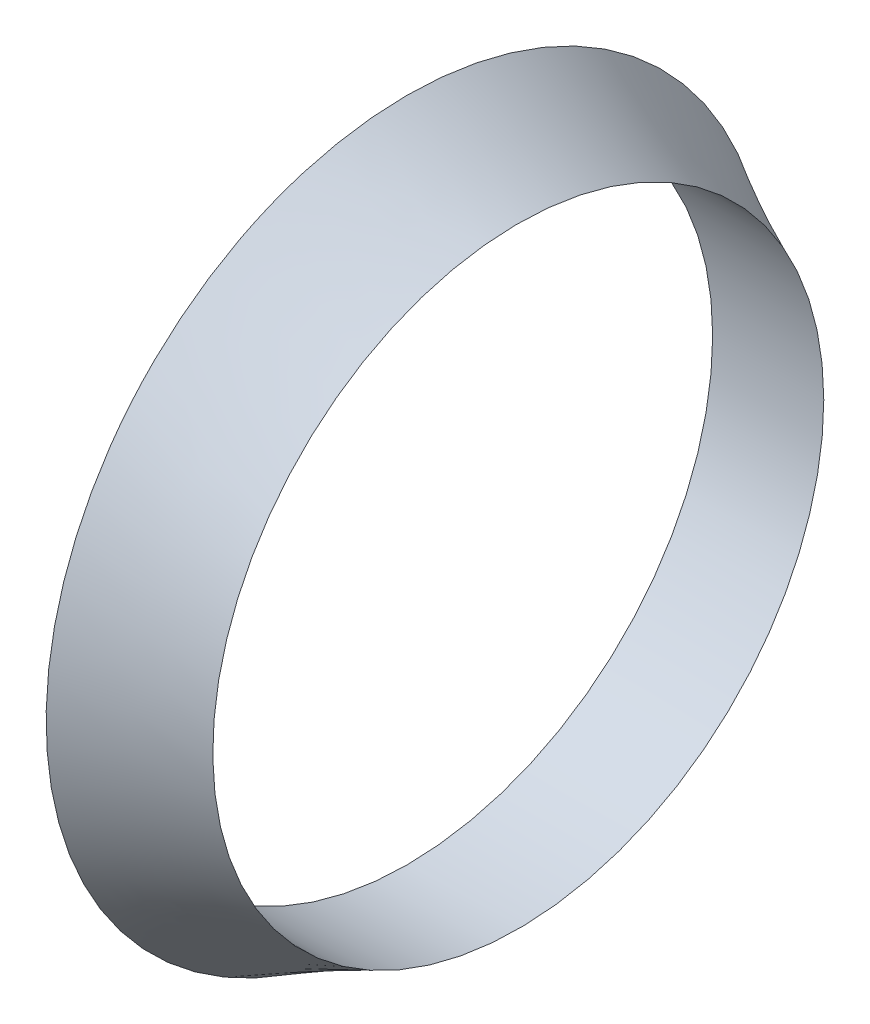
ISO-10303-21;
HEADER;
FILE_DESCRIPTION(('STEP AP214'),'2;1');
FILE_NAME('part.step','',(''),(''),'','','');
FILE_SCHEMA(('AUTOMOTIVE_DESIGN { 1 0 10303 214 1 1 1 1 }'));
ENDSEC;
DATA;
#1=APPLICATION_CONTEXT('core data for automotive mechanical design processes');
#2=APPLICATION_PROTOCOL_DEFINITION('international standard','automotive_design',2000,#1);
#3=PRODUCT_CONTEXT('',#1,'mechanical');
#4=PRODUCT('Part','Part','',(#3));
#5=PRODUCT_RELATED_PRODUCT_CATEGORY('part','',(#4));
#6=PRODUCT_DEFINITION_FORMATION('','',#4);
#7=PRODUCT_DEFINITION_CONTEXT('part definition',#1,'design');
#8=PRODUCT_DEFINITION('design','',#6,#7);
#9=PRODUCT_DEFINITION_SHAPE('','',#8);
#10=(LENGTH_UNIT() NAMED_UNIT(*) SI_UNIT(.MILLI.,.METRE.));
#11=(NAMED_UNIT(*) PLANE_ANGLE_UNIT() SI_UNIT($,.RADIAN.));
#12=(NAMED_UNIT(*) SI_UNIT($,.STERADIAN.) SOLID_ANGLE_UNIT());
#13=UNCERTAINTY_MEASURE_WITH_UNIT(LENGTH_MEASURE(1.E-05),#10,'distance_accuracy_value','');
#14=(GEOMETRIC_REPRESENTATION_CONTEXT(3) GLOBAL_UNCERTAINTY_ASSIGNED_CONTEXT((#13)) GLOBAL_UNIT_ASSIGNED_CONTEXT((#10,
#11,#12)) REPRESENTATION_CONTEXT('',''));
#15=CARTESIAN_POINT('',(0.,0.,0.));
#16=DIRECTION('',(0.,0.,1.));
#17=DIRECTION('',(1.,0.,0.));
#18=AXIS2_PLACEMENT_3D('',#15,#16,#17);
#19=CARTESIAN_POINT('',(0.,0.,0.));
#20=DIRECTION('',(1.,0.,0.));
#21=DIRECTION('',(0.,0.,-1.));
#22=AXIS2_PLACEMENT_3D('',#19,#20,#21);
#23=PLANE('',#22);
#24=CARTESIAN_POINT('',(0.,0.,7.20947868796138E-13));
#25=DIRECTION('',(1.,0.,0.));
#26=DIRECTION('',(0.,0.,-1.));
#27=AXIS2_PLACEMENT_3D('',#24,#25,#26);
#28=CIRCLE('',#27,55.0000000000001);
#29=CARTESIAN_POINT('',(0.,0.,-54.9999999999993));
#30=VERTEX_POINT('',#29);
#31=EDGE_CURVE('E49',#30,#30,#28,.T.);
#32=ORIENTED_EDGE('',*,*,#31,.T.);
#33=EDGE_LOOP('',(#32));
#34=FACE_BOUND('',#33,.T.);
#35=CARTESIAN_POINT('',(0.,0.,0.));
#36=DIRECTION('',(1.,0.,0.));
#37=DIRECTION('',(0.,0.,-1.));
#38=AXIS2_PLACEMENT_3D('',#35,#36,#37);
#39=CIRCLE('',#38,65.);
#40=CARTESIAN_POINT('',(0.,-52.5620886920741,-38.2390746792667));
#41=VERTEX_POINT('',#40);
#42=EDGE_CURVE('E11',#41,#41,#39,.T.);
#43=ORIENTED_EDGE('',*,*,#42,.F.);
#44=EDGE_LOOP('',(#43));
#45=FACE_BOUND('',#44,.T.);
#46=ADVANCED_FACE('F41',(#34,#45),#23,.F.);
#47=CARTESIAN_POINT('',(20.0000000000003,-35.7984123857661,-41.7549239091458));
#48=CARTESIAN_POINT('',(0.,-52.5620886920741,-38.2390746792667));
#49=CARTESIAN_POINT('',(19.9999999999998,-119.308260204059,29.8419008623865));
#50=CARTESIAN_POINT('',(0.,-129.040238050608,66.8851027048815));
#51=CARTESIAN_POINT('',(19.9999999999992,-47.7114354325271,113.35174868068));
#52=CARTESIAN_POINT('',(0.,-23.9160606664593,143.363252063415));
#53=CARTESIAN_POINT('',(19.9999999999997,35.7984123857662,41.7549239091475));
#54=CARTESIAN_POINT('',(0.,52.5620886920741,38.2390746792667));
#55=CARTESIAN_POINT('',(20.0000000000002,119.308260204059,-29.8419008623849));
#56=CARTESIAN_POINT('',(0.,129.040238050608,-66.8851027048813));
#57=CARTESIAN_POINT('',(20.0000000000008,47.7114354325271,-113.351748680678));
#58=CARTESIAN_POINT('',(0.,23.9160606664594,-143.363252063415));
#59=CARTESIAN_POINT('',(20.0000000000003,-35.7984123857661,-41.7549239091458));
#60=CARTESIAN_POINT('',(0.,-52.5620886920741,-38.2390746792667));
#61=(BOUNDED_SURFACE() B_SPLINE_SURFACE(3,1,((#47,#48),(#49,#50),(#51,#52),(#53,#54),(#55,#56),
(#57,#58),(#59,#60)),.UNSPECIFIED.,.T.,.F.,.F.) B_SPLINE_SURFACE_WITH_KNOTS((4,3,4),(2,2),(0.,
0.5,1.),(0.,1.),.UNSPECIFIED.) GEOMETRIC_REPRESENTATION_ITEM() RATIONAL_B_SPLINE_SURFACE(((1.,
1.),(0.333333333333333,0.333333333333333),(0.333333333333333,0.333333333333333),(1.,1.),
(0.333333333333333,0.333333333333334),(0.333333333333333,0.333333333333334),(1.,1.))) REPRESENTATION_ITEM('') SURFACE());
#62=CARTESIAN_POINT('',(20.,0.,8.60607122349863E-13));
#63=DIRECTION('',(1.,0.,0.));
#64=DIRECTION('',(0.,0.,-1.));
#65=AXIS2_PLACEMENT_3D('',#62,#63,#64);
#66=CIRCLE('',#65,55.0000000000001);
#67=CARTESIAN_POINT('',(20.0000000000003,-35.7984123857661,-41.7549239091458));
#68=VERTEX_POINT('',#67);
#69=EDGE_CURVE('E55',#68,#68,#66,.T.);
#70=CARTESIAN_POINT('',(20.0000000000003,-35.7984123857661,-41.7549239091458));
#71=CARTESIAN_POINT('',(19.791666666667,-35.9730340139568,-41.7183004796679));
#72=CARTESIAN_POINT('',(19.5833333333336,-36.1476556421476,-41.68167705019));
#73=CARTESIAN_POINT('',(19.1666666666669,-36.496898898529,-41.6084301912341));
#74=CARTESIAN_POINT('',(18.9583333333336,-36.6715205267197,-41.5718067617562));
#75=CARTESIAN_POINT('',(18.5416666666669,-37.0207637831011,-41.4985599028004));
#76=CARTESIAN_POINT('',(18.3333333333336,-37.1953854112918,-41.4619364733225));
#77=CARTESIAN_POINT('',(17.9166666666669,-37.5446286676732,-41.3886896143667));
#78=CARTESIAN_POINT('',(17.7083333333336,-37.7192502958639,-41.3520661848888));
#79=CARTESIAN_POINT('',(17.2916666666669,-38.0684935522454,-41.278819325933));
#80=CARTESIAN_POINT('',(17.0833333333336,-38.243115180436,-41.2421958964551));
#81=CARTESIAN_POINT('',(16.6666666666669,-38.5923584368175,-41.1689490374993));
#82=CARTESIAN_POINT('',(16.4583333333336,-38.7669800650082,-41.1323256080214));
#83=CARTESIAN_POINT('',(16.0416666666669,-39.1162233213896,-41.0590787490655));
#84=CARTESIAN_POINT('',(15.8333333333336,-39.2908449495803,-41.0224553195876));
#85=CARTESIAN_POINT('',(15.4166666666669,-39.6400882059617,-40.9492084606318));
#86=CARTESIAN_POINT('',(15.2083333333336,-39.8147098341524,-40.9125850311539));
#87=CARTESIAN_POINT('',(14.7916666666669,-40.1639530905338,-40.8393381721981));
#88=CARTESIAN_POINT('',(14.5833333333335,-40.3385747187245,-40.8027147427202));
#89=CARTESIAN_POINT('',(14.1666666666669,-40.687817975106,-40.7294678837644));
#90=CARTESIAN_POINT('',(13.9583333333335,-40.8624396032967,-40.6928444542865));
#91=CARTESIAN_POINT('',(13.5416666666669,-41.2116828596781,-40.6195975953307));
#92=CARTESIAN_POINT('',(13.3333333333335,-41.3863044878688,-40.5829741658527));
#93=CARTESIAN_POINT('',(12.9166666666669,-41.7355477442502,-40.5097273068969));
#94=CARTESIAN_POINT('',(12.7083333333335,-41.9101693724409,-40.473103877419));
#95=CARTESIAN_POINT('',(12.2916666666668,-42.2594126288223,-40.3998570184632));
#96=CARTESIAN_POINT('',(12.0833333333335,-42.434034257013,-40.3632335889853));
#97=CARTESIAN_POINT('',(11.6666666666668,-42.7832775133945,-40.2899867300295));
#98=CARTESIAN_POINT('',(11.4583333333335,-42.9578991415852,-40.2533633005516));
#99=CARTESIAN_POINT('',(11.0416666666668,-43.3071423979666,-40.1801164415958));
#100=CARTESIAN_POINT('',(10.8333333333335,-43.4817640261573,-40.1434930121179));
#101=CARTESIAN_POINT('',(10.4166666666668,-43.8310072825387,-40.0702461531621));
#102=CARTESIAN_POINT('',(10.2083333333335,-44.0056289107294,-40.0336227236842));
#103=CARTESIAN_POINT('',(9.79166666666681,-44.3548721671108,-39.9603758647283));
#104=CARTESIAN_POINT('',(9.58333333333347,-44.5294937953015,-39.9237524352504));
#105=CARTESIAN_POINT('',(9.1666666666668,-44.878737051683,-39.8505055762946));
#106=CARTESIAN_POINT('',(8.95833333333346,-45.0533586798737,-39.8138821468167));
#107=CARTESIAN_POINT('',(8.54166666666679,-45.4026019362551,-39.7406352878609));
#108=CARTESIAN_POINT('',(8.33333333333345,-45.5772235644458,-39.704011858383));
#109=CARTESIAN_POINT('',(7.91666666666678,-45.9264668208272,-39.6307649994272));
#110=CARTESIAN_POINT('',(7.70833333333345,-46.1010884490179,-39.5941415699493));
#111=CARTESIAN_POINT('',(7.29166666666677,-46.4503317053993,-39.5208947109935));
#112=CARTESIAN_POINT('',(7.08333333333344,-46.62495333359,-39.4842712815156));
#113=CARTESIAN_POINT('',(6.66666666666676,-46.9741965899714,-39.4110244225597));
#114=CARTESIAN_POINT('',(6.45833333333343,-47.1488182181622,-39.3744009930818));
#115=CARTESIAN_POINT('',(6.04166666666676,-47.4980614745436,-39.301154134126));
#116=CARTESIAN_POINT('',(5.83333333333342,-47.6726831027343,-39.2645307046481));
#117=CARTESIAN_POINT('',(5.41666666666675,-48.0219263591157,-39.1912838456923));
#118=CARTESIAN_POINT('',(5.20833333333341,-48.1965479873064,-39.1546604162144));
#119=CARTESIAN_POINT('',(4.79166666666674,-48.5457912436878,-39.0814135572586));
#120=CARTESIAN_POINT('',(4.5833333333334,-48.7204128718785,-39.0447901277807));
#121=CARTESIAN_POINT('',(4.16666666666673,-49.06965612826,-38.9715432688249));
#122=CARTESIAN_POINT('',(3.95833333333339,-49.2442777564507,-38.934919839347));
#123=CARTESIAN_POINT('',(3.54166666666672,-49.5935210128321,-38.8616729803911));
#124=CARTESIAN_POINT('',(3.33333333333338,-49.7681426410228,-38.8250495509132));
#125=CARTESIAN_POINT('',(2.91666666666671,-50.1173858974042,-38.7518026919574));
#126=CARTESIAN_POINT('',(2.70833333333337,-50.2920075255949,-38.7151792624795));
#127=CARTESIAN_POINT('',(2.2916666666667,-50.6412507819763,-38.6419324035237));
#128=CARTESIAN_POINT('',(2.08333333333336,-50.815872410167,-38.6053089740458));
#129=CARTESIAN_POINT('',(1.66666666666669,-51.1651156665484,-38.53206211509));
#130=CARTESIAN_POINT('',(1.45833333333335,-51.3397372947391,-38.4954386856121));
#131=CARTESIAN_POINT('',(1.04166666666668,-51.6889805511206,-38.4221918266563));
#132=CARTESIAN_POINT('',(0.833333333333345,-51.8636021793113,-38.3855683971784));
#133=CARTESIAN_POINT('',(0.416666666666674,-52.2128454356927,-38.3123215382225));
#134=CARTESIAN_POINT('',(0.208333333333339,-52.3874670638834,-38.2756981087446));
#135=CARTESIAN_POINT('',(0.,-52.5620886920741,-38.2390746792667));
#136=B_SPLINE_CURVE_WITH_KNOTS('',3,(#70,#71,#72,#73,#74,#75,#76,#77,#78,#79,#80,#81,#82,#83,
#84,#85,#86,#87,#88,#89,#90,#91,#92,#93,#94,#95,#96,#97,#98,#99,#100,#101,#102,#103,#104,#105,
#106,#107,#108,#109,#110,#111,#112,#113,#114,#115,#116,#117,#118,#119,#120,#121,#122,#123,#124,
#125,#126,#127,#128,#129,#130,#131,#132,#133,#134,#135),.UNSPECIFIED.,.F.,.F.,(4,2,2,2,2,2,2,2,
2,2,2,2,2,2,2,2,2,2,2,2,2,2,2,2,2,2,2,2,2,2,2,2,4),(0.,0.822879637351831,1.64575927470367,
2.4686389120555,3.29151854940734,4.11439818675916,4.937277824111,5.76015746146283,
6.58303709881467,7.4059167361665,8.22879637351833,9.05167601087017,9.874555648222,
10.6974352855738,11.5203149229257,12.3431945602775,13.1660741976293,13.9889538349812,
14.811833472333,15.6347131096848,16.4575927470367,17.2804723843885,18.1033520217403,
18.9262316590922,19.749111296444,20.5719909337958,21.3948705711477,22.2177502084995,
23.0406298458513,23.8635094832032,24.686389120555,25.5092687579068,26.3321483952587),.UNSPECIFIED.);
#137=EDGE_CURVE('BSEAM79',#68,#41,#136,.T.);
#138=ORIENTED_EDGE('',*,*,#69,.F.);
#139=ORIENTED_EDGE('',*,*,#42,.T.);
#140=ORIENTED_EDGE('',*,*,#137,.T.);
#141=ORIENTED_EDGE('',*,*,#137,.F.);
#142=EDGE_LOOP('',(#138,#140,#139,#141));
#143=FACE_BOUND('',#142,.T.);
#144=ADVANCED_FACE('F79',(#143),#61,.T.);
#145=CARTESIAN_POINT('',(-10.,0.,6.51118242019275E-13));
#146=DIRECTION('',(1.,0.,0.));
#147=DIRECTION('',(0.,0.,-1.));
#148=AXIS2_PLACEMENT_3D('',#145,#146,#147);
#149=CYLINDRICAL_SURFACE('',#148,55.0000000000001);
#150=ORIENTED_EDGE('',*,*,#69,.T.);
#151=EDGE_LOOP('',(#150));
#152=FACE_BOUND('',#151,.T.);
#153=ORIENTED_EDGE('',*,*,#31,.F.);
#154=EDGE_LOOP('',(#153));
#155=FACE_BOUND('',#154,.T.);
#156=ADVANCED_FACE('F71',(#152,#155),#149,.F.);
#157=CLOSED_SHELL('',(#46,#144,#156));
#158=MANIFOLD_SOLID_BREP('B2',#157);
#159=ADVANCED_BREP_SHAPE_REPRESENTATION('',(#18,#158),#14);
#160=SHAPE_DEFINITION_REPRESENTATION(#9,#159);
ENDSEC;
END-ISO-10303-21;
